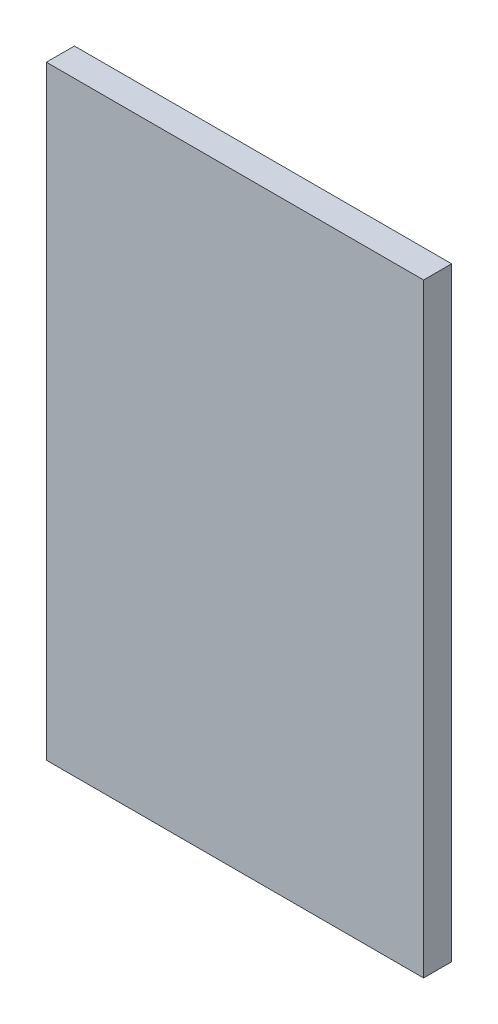
ISO-10303-21;
HEADER;
FILE_DESCRIPTION(('STEP AP214'),'2;1');
FILE_NAME('part.step','',(''),(''),'','','');
FILE_SCHEMA(('AUTOMOTIVE_DESIGN { 1 0 10303 214 1 1 1 1 }'));
ENDSEC;
DATA;
#1=APPLICATION_CONTEXT('core data for automotive mechanical design processes');
#2=APPLICATION_PROTOCOL_DEFINITION('international standard','automotive_design',2000,#1);
#3=PRODUCT_CONTEXT('',#1,'mechanical');
#4=PRODUCT('Part','Part','',(#3));
#5=PRODUCT_RELATED_PRODUCT_CATEGORY('part','',(#4));
#6=PRODUCT_DEFINITION_FORMATION('','',#4);
#7=PRODUCT_DEFINITION_CONTEXT('part definition',#1,'design');
#8=PRODUCT_DEFINITION('design','',#6,#7);
#9=PRODUCT_DEFINITION_SHAPE('','',#8);
#10=(LENGTH_UNIT() NAMED_UNIT(*) SI_UNIT(.MILLI.,.METRE.));
#11=(NAMED_UNIT(*) PLANE_ANGLE_UNIT() SI_UNIT($,.RADIAN.));
#12=(NAMED_UNIT(*) SI_UNIT($,.STERADIAN.) SOLID_ANGLE_UNIT());
#13=UNCERTAINTY_MEASURE_WITH_UNIT(LENGTH_MEASURE(1.E-05),#10,'distance_accuracy_value','');
#14=(GEOMETRIC_REPRESENTATION_CONTEXT(3) GLOBAL_UNCERTAINTY_ASSIGNED_CONTEXT((#13)) GLOBAL_UNIT_ASSIGNED_CONTEXT((#10,
#11,#12)) REPRESENTATION_CONTEXT('',''));
#15=CARTESIAN_POINT('',(0.,0.,0.));
#16=DIRECTION('',(0.,0.,1.));
#17=DIRECTION('',(1.,0.,0.));
#18=AXIS2_PLACEMENT_3D('',#15,#16,#17);
#19=CARTESIAN_POINT('',(-39.,-62.5,-5.8));
#20=DIRECTION('',(1.,0.,0.));
#21=DIRECTION('',(0.,1.,0.));
#22=AXIS2_PLACEMENT_3D('',#19,#20,#21);
#23=PLANE('',#22);
#24=DIRECTION('',(0.,1.,0.));
#25=VECTOR('',#24,1.);
#26=CARTESIAN_POINT('',(-39.,-62.5,0.));
#27=LINE('',#26,#25);
#28=CARTESIAN_POINT('',(-39.,-62.5,0.));
#29=VERTEX_POINT('',#28);
#30=CARTESIAN_POINT('',(-39.,62.5,0.));
#31=VERTEX_POINT('',#30);
#32=EDGE_CURVE('E95',#29,#31,#27,.T.);
#33=ORIENTED_EDGE('',*,*,#32,.T.);
#34=DIRECTION('',(0.,0.,1.));
#35=VECTOR('',#34,1.);
#36=CARTESIAN_POINT('',(-39.,62.5,-5.8));
#37=LINE('',#36,#35);
#38=CARTESIAN_POINT('',(-39.,62.5,-5.8));
#39=VERTEX_POINT('',#38);
#40=EDGE_CURVE('E11',#39,#31,#37,.T.);
#41=ORIENTED_EDGE('',*,*,#40,.F.);
#42=DIRECTION('',(0.,1.,0.));
#43=VECTOR('',#42,1.);
#44=CARTESIAN_POINT('',(-39.,-62.5,-5.8));
#45=LINE('',#44,#43);
#46=CARTESIAN_POINT('',(-39.,-62.5,-5.8));
#47=VERTEX_POINT('',#46);
#48=EDGE_CURVE('E81',#47,#39,#45,.T.);
#49=ORIENTED_EDGE('',*,*,#48,.F.);
#50=DIRECTION('',(0.,0.,1.));
#51=VECTOR('',#50,1.);
#52=CARTESIAN_POINT('',(-39.,-62.5,-5.8));
#53=LINE('',#52,#51);
#54=EDGE_CURVE('E48',#47,#29,#53,.T.);
#55=ORIENTED_EDGE('',*,*,#54,.T.);
#56=EDGE_LOOP('',(#33,#41,#49,#55));
#57=FACE_BOUND('',#56,.T.);
#58=ADVANCED_FACE('F32',(#57),#23,.F.);
#59=CARTESIAN_POINT('',(-39.,62.5,-5.8));
#60=DIRECTION('',(0.,-1.,0.));
#61=DIRECTION('',(1.,0.,0.));
#62=AXIS2_PLACEMENT_3D('',#59,#60,#61);
#63=PLANE('',#62);
#64=DIRECTION('',(1.,0.,0.));
#65=VECTOR('',#64,1.);
#66=CARTESIAN_POINT('',(-39.,62.5,0.));
#67=LINE('',#66,#65);
#68=CARTESIAN_POINT('',(39.,62.5,0.));
#69=VERTEX_POINT('',#68);
#70=EDGE_CURVE('E86',#31,#69,#67,.T.);
#71=ORIENTED_EDGE('',*,*,#70,.T.);
#72=DIRECTION('',(0.,0.,1.));
#73=VECTOR('',#72,1.);
#74=CARTESIAN_POINT('',(39.,62.5,-5.8));
#75=LINE('',#74,#73);
#76=CARTESIAN_POINT('',(39.,62.5,-5.8));
#77=VERTEX_POINT('',#76);
#78=EDGE_CURVE('E40',#77,#69,#75,.T.);
#79=ORIENTED_EDGE('',*,*,#78,.F.);
#80=DIRECTION('',(1.,0.,0.));
#81=VECTOR('',#80,1.);
#82=CARTESIAN_POINT('',(-39.,62.5,-5.8));
#83=LINE('',#82,#81);
#84=EDGE_CURVE('E73',#39,#77,#83,.T.);
#85=ORIENTED_EDGE('',*,*,#84,.F.);
#86=ORIENTED_EDGE('',*,*,#40,.T.);
#87=EDGE_LOOP('',(#71,#79,#85,#86));
#88=FACE_BOUND('',#87,.T.);
#89=ADVANCED_FACE('F85',(#88),#63,.F.);
#90=CARTESIAN_POINT('',(39.,-62.5,-5.8));
#91=DIRECTION('',(1.,0.,0.));
#92=DIRECTION('',(0.,1.,0.));
#93=AXIS2_PLACEMENT_3D('',#90,#91,#92);
#94=PLANE('',#93);
#95=DIRECTION('',(0.,1.,0.));
#96=VECTOR('',#95,1.);
#97=CARTESIAN_POINT('',(39.,-62.5,0.));
#98=LINE('',#97,#96);
#99=CARTESIAN_POINT('',(39.,-62.5,0.));
#100=VERTEX_POINT('',#99);
#101=EDGE_CURVE('E98',#100,#69,#98,.T.);
#102=ORIENTED_EDGE('',*,*,#101,.F.);
#103=DIRECTION('',(0.,0.,1.));
#104=VECTOR('',#103,1.);
#105=CARTESIAN_POINT('',(39.,-62.5,-5.8));
#106=LINE('',#105,#104);
#107=CARTESIAN_POINT('',(39.,-62.5,-5.8));
#108=VERTEX_POINT('',#107);
#109=EDGE_CURVE('E62',#108,#100,#106,.T.);
#110=ORIENTED_EDGE('',*,*,#109,.F.);
#111=DIRECTION('',(0.,1.,0.));
#112=VECTOR('',#111,1.);
#113=CARTESIAN_POINT('',(39.,-62.5,-5.8));
#114=LINE('',#113,#112);
#115=EDGE_CURVE('E80',#108,#77,#114,.T.);
#116=ORIENTED_EDGE('',*,*,#115,.T.);
#117=ORIENTED_EDGE('',*,*,#78,.T.);
#118=EDGE_LOOP('',(#102,#110,#116,#117));
#119=FACE_BOUND('',#118,.T.);
#120=ADVANCED_FACE('F89',(#119),#94,.T.);
#121=CARTESIAN_POINT('',(-39.,-62.5,-5.8));
#122=DIRECTION('',(0.,-1.,0.));
#123=DIRECTION('',(1.,0.,0.));
#124=AXIS2_PLACEMENT_3D('',#121,#122,#123);
#125=PLANE('',#124);
#126=DIRECTION('',(1.,0.,0.));
#127=VECTOR('',#126,1.);
#128=CARTESIAN_POINT('',(-39.,-62.5,0.));
#129=LINE('',#128,#127);
#130=EDGE_CURVE('E100',#29,#100,#129,.T.);
#131=ORIENTED_EDGE('',*,*,#130,.F.);
#132=ORIENTED_EDGE('',*,*,#54,.F.);
#133=DIRECTION('',(1.,0.,0.));
#134=VECTOR('',#133,1.);
#135=CARTESIAN_POINT('',(-39.,-62.5,-5.8));
#136=LINE('',#135,#134);
#137=EDGE_CURVE('E90',#47,#108,#136,.T.);
#138=ORIENTED_EDGE('',*,*,#137,.T.);
#139=ORIENTED_EDGE('',*,*,#109,.T.);
#140=EDGE_LOOP('',(#131,#132,#138,#139));
#141=FACE_BOUND('',#140,.T.);
#142=ADVANCED_FACE('F106',(#141),#125,.T.);
#143=CARTESIAN_POINT('',(0.,0.,-5.8));
#144=DIRECTION('',(0.,0.,-1.));
#145=DIRECTION('',(-1.,0.,0.));
#146=AXIS2_PLACEMENT_3D('',#143,#144,#145);
#147=PLANE('',#146);
#148=ORIENTED_EDGE('',*,*,#48,.T.);
#149=ORIENTED_EDGE('',*,*,#84,.T.);
#150=ORIENTED_EDGE('',*,*,#115,.F.);
#151=ORIENTED_EDGE('',*,*,#137,.F.);
#152=EDGE_LOOP('',(#148,#149,#150,#151));
#153=FACE_BOUND('',#152,.T.);
#154=ADVANCED_FACE('F77',(#153),#147,.T.);
#155=CARTESIAN_POINT('',(0.,0.,0.));
#156=DIRECTION('',(0.,0.,-1.));
#157=DIRECTION('',(-1.,0.,0.));
#158=AXIS2_PLACEMENT_3D('',#155,#156,#157);
#159=PLANE('',#158);
#160=ORIENTED_EDGE('',*,*,#32,.F.);
#161=ORIENTED_EDGE('',*,*,#130,.T.);
#162=ORIENTED_EDGE('',*,*,#101,.T.);
#163=ORIENTED_EDGE('',*,*,#70,.F.);
#164=EDGE_LOOP('',(#160,#161,#162,#163));
#165=FACE_BOUND('',#164,.T.);
#166=ADVANCED_FACE('F105',(#165),#159,.F.);
#167=CLOSED_SHELL('',(#58,#89,#120,#142,#154,#166));
#168=MANIFOLD_SOLID_BREP('B2',#167);
#169=ADVANCED_BREP_SHAPE_REPRESENTATION('',(#18,#168),#14);
#170=SHAPE_DEFINITION_REPRESENTATION(#9,#169);
ENDSEC;
END-ISO-10303-21;
